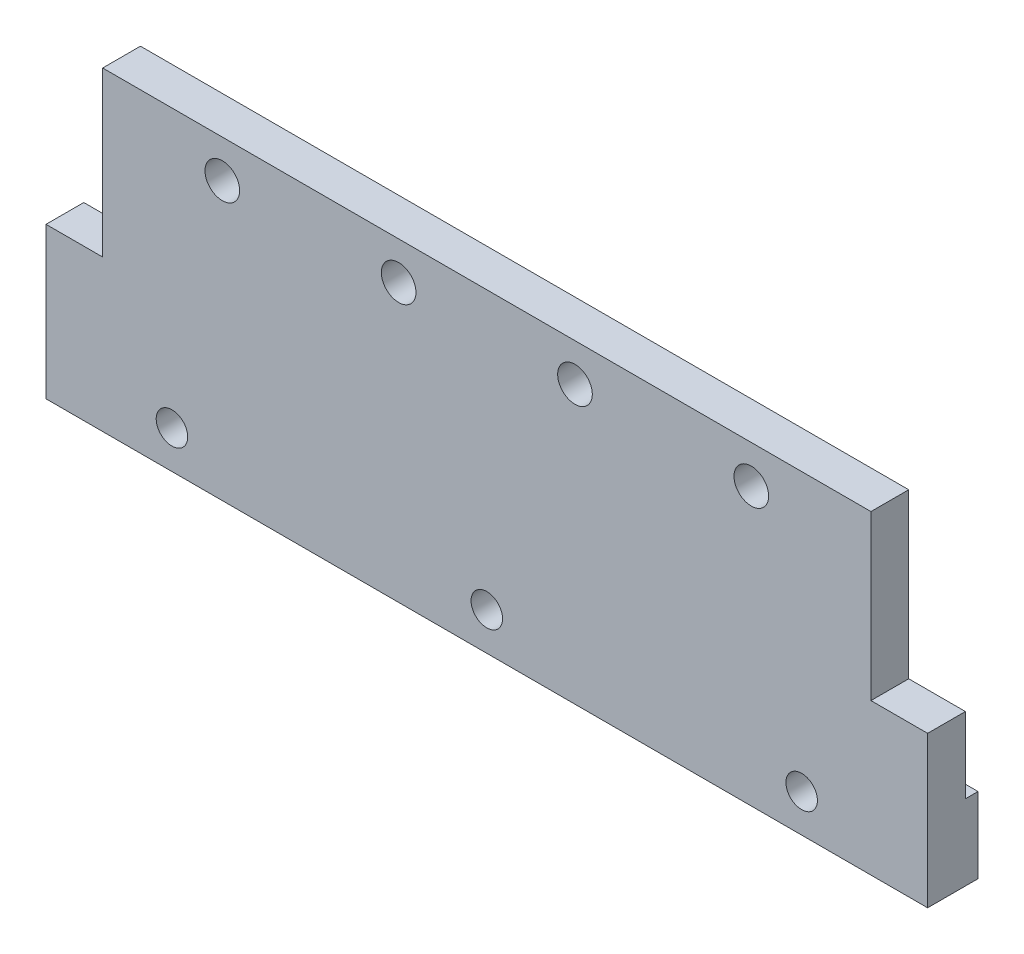
ISO-10303-21;
HEADER;
FILE_DESCRIPTION(('STEP AP214'),'2;1');
FILE_NAME('part.step','',(''),(''),'','','');
FILE_SCHEMA(('AUTOMOTIVE_DESIGN { 1 0 10303 214 1 1 1 1 }'));
ENDSEC;
DATA;
#1=APPLICATION_CONTEXT('core data for automotive mechanical design processes');
#2=APPLICATION_PROTOCOL_DEFINITION('international standard','automotive_design',2000,#1);
#3=PRODUCT_CONTEXT('',#1,'mechanical');
#4=PRODUCT('Part','Part','',(#3));
#5=PRODUCT_RELATED_PRODUCT_CATEGORY('part','',(#4));
#6=PRODUCT_DEFINITION_FORMATION('','',#4);
#7=PRODUCT_DEFINITION_CONTEXT('part definition',#1,'design');
#8=PRODUCT_DEFINITION('design','',#6,#7);
#9=PRODUCT_DEFINITION_SHAPE('','',#8);
#10=(LENGTH_UNIT() NAMED_UNIT(*) SI_UNIT(.MILLI.,.METRE.));
#11=(NAMED_UNIT(*) PLANE_ANGLE_UNIT() SI_UNIT($,.RADIAN.));
#12=(NAMED_UNIT(*) SI_UNIT($,.STERADIAN.) SOLID_ANGLE_UNIT());
#13=UNCERTAINTY_MEASURE_WITH_UNIT(LENGTH_MEASURE(1.E-05),#10,'distance_accuracy_value','');
#14=(GEOMETRIC_REPRESENTATION_CONTEXT(3) GLOBAL_UNCERTAINTY_ASSIGNED_CONTEXT((#13)) GLOBAL_UNIT_ASSIGNED_CONTEXT((#10,
#11,#12)) REPRESENTATION_CONTEXT('',''));
#15=CARTESIAN_POINT('',(0.,0.,0.));
#16=DIRECTION('',(0.,0.,1.));
#17=DIRECTION('',(1.,0.,0.));
#18=AXIS2_PLACEMENT_3D('',#15,#16,#17);
#19=CARTESIAN_POINT('',(70.,-25.,6.));
#20=DIRECTION('',(-1.,0.,0.));
#21=DIRECTION('',(0.,0.,1.));
#22=AXIS2_PLACEMENT_3D('',#19,#20,#21);
#23=PLANE('',#22);
#24=DIRECTION('',(0.,1.,0.));
#25=VECTOR('',#24,1.);
#26=CARTESIAN_POINT('',(70.,-25.,0.));
#27=LINE('',#26,#25);
#28=CARTESIAN_POINT('',(70.,-13.,0.));
#29=VERTEX_POINT('',#28);
#30=CARTESIAN_POINT('',(70.,-0.999999999999997,0.));
#31=VERTEX_POINT('',#30);
#32=EDGE_CURVE('E148',#29,#31,#27,.T.);
#33=ORIENTED_EDGE('',*,*,#32,.T.);
#34=DIRECTION('',(0.,0.,1.));
#35=VECTOR('',#34,1.);
#36=CARTESIAN_POINT('',(70.,-0.999999999999997,-2.000025));
#37=LINE('',#36,#35);
#38=CARTESIAN_POINT('',(70.,-0.999999999999997,6.));
#39=VERTEX_POINT('',#38);
#40=EDGE_CURVE('E226',#31,#39,#37,.T.);
#41=ORIENTED_EDGE('',*,*,#40,.T.);
#42=DIRECTION('',(0.,1.,0.));
#43=VECTOR('',#42,1.);
#44=CARTESIAN_POINT('',(70.,-25.,6.));
#45=LINE('',#44,#43);
#46=CARTESIAN_POINT('',(70.,-25.,6.));
#47=VERTEX_POINT('',#46);
#48=EDGE_CURVE('E133',#47,#39,#45,.T.);
#49=ORIENTED_EDGE('',*,*,#48,.F.);
#50=DIRECTION('',(0.,0.,-1.));
#51=VECTOR('',#50,1.);
#52=CARTESIAN_POINT('',(70.,-25.,6.));
#53=LINE('',#52,#51);
#54=CARTESIAN_POINT('',(70.,-25.,-2.));
#55=VERTEX_POINT('',#54);
#56=EDGE_CURVE('E142',#47,#55,#53,.T.);
#57=ORIENTED_EDGE('',*,*,#56,.T.);
#58=DIRECTION('',(0.,-1.,0.));
#59=VECTOR('',#58,1.);
#60=CARTESIAN_POINT('',(70.,-25.,-2.));
#61=LINE('',#60,#59);
#62=CARTESIAN_POINT('',(70.,-13.,-2.));
#63=VERTEX_POINT('',#62);
#64=EDGE_CURVE('E301',#63,#55,#61,.T.);
#65=ORIENTED_EDGE('',*,*,#64,.F.);
#66=DIRECTION('',(0.,0.,1.));
#67=VECTOR('',#66,1.);
#68=CARTESIAN_POINT('',(70.,-13.,-2.));
#69=LINE('',#68,#67);
#70=EDGE_CURVE('E161',#63,#29,#69,.T.);
#71=ORIENTED_EDGE('',*,*,#70,.T.);
#72=EDGE_LOOP('',(#33,#41,#49,#57,#65,#71));
#73=FACE_BOUND('',#72,.T.);
#74=ADVANCED_FACE('F37',(#73),#23,.F.);
#75=CARTESIAN_POINT('',(-70.,25.,6.));
#76=DIRECTION('',(0.,-1.,0.));
#77=DIRECTION('',(0.,0.,-1.));
#78=AXIS2_PLACEMENT_3D('',#75,#76,#77);
#79=PLANE('',#78);
#80=DIRECTION('',(-1.,0.,0.));
#81=VECTOR('',#80,1.);
#82=CARTESIAN_POINT('',(-70.,25.,6.));
#83=LINE('',#82,#81);
#84=CARTESIAN_POINT('',(61.,25.,6.));
#85=VERTEX_POINT('',#84);
#86=CARTESIAN_POINT('',(-61.,25.,6.));
#87=VERTEX_POINT('',#86);
#88=EDGE_CURVE('E125',#85,#87,#83,.T.);
#89=ORIENTED_EDGE('',*,*,#88,.F.);
#90=DIRECTION('',(0.,0.,1.));
#91=VECTOR('',#90,1.);
#92=CARTESIAN_POINT('',(61.,25.,-2.000025));
#93=LINE('',#92,#91);
#94=CARTESIAN_POINT('',(61.,25.,0.));
#95=VERTEX_POINT('',#94);
#96=EDGE_CURVE('E110',#95,#85,#93,.T.);
#97=ORIENTED_EDGE('',*,*,#96,.F.);
#98=DIRECTION('',(-1.,0.,0.));
#99=VECTOR('',#98,1.);
#100=CARTESIAN_POINT('',(-70.,25.,0.));
#101=LINE('',#100,#99);
#102=CARTESIAN_POINT('',(-61.,25.,0.));
#103=VERTEX_POINT('',#102);
#104=EDGE_CURVE('E145',#95,#103,#101,.T.);
#105=ORIENTED_EDGE('',*,*,#104,.T.);
#106=DIRECTION('',(0.,0.,1.));
#107=VECTOR('',#106,1.);
#108=CARTESIAN_POINT('',(-61.,25.,-2.000025));
#109=LINE('',#108,#107);
#110=EDGE_CURVE('E131',#103,#87,#109,.T.);
#111=ORIENTED_EDGE('',*,*,#110,.T.);
#112=EDGE_LOOP('',(#89,#97,#105,#111));
#113=FACE_BOUND('',#112,.T.);
#114=ADVANCED_FACE('F129',(#113),#79,.F.);
#115=CARTESIAN_POINT('',(-70.,-25.,6.));
#116=DIRECTION('',(1.,0.,0.));
#117=DIRECTION('',(0.,0.,-1.));
#118=AXIS2_PLACEMENT_3D('',#115,#116,#117);
#119=PLANE('',#118);
#120=DIRECTION('',(0.,-1.,0.));
#121=VECTOR('',#120,1.);
#122=CARTESIAN_POINT('',(-70.,-25.,6.));
#123=LINE('',#122,#121);
#124=CARTESIAN_POINT('',(-70.,-0.999999999999997,6.));
#125=VERTEX_POINT('',#124);
#126=CARTESIAN_POINT('',(-70.,-25.,6.));
#127=VERTEX_POINT('',#126);
#128=EDGE_CURVE('E132',#125,#127,#123,.T.);
#129=ORIENTED_EDGE('',*,*,#128,.F.);
#130=DIRECTION('',(0.,0.,1.));
#131=VECTOR('',#130,1.);
#132=CARTESIAN_POINT('',(-70.,-0.999999999999997,-2.000025));
#133=LINE('',#132,#131);
#134=CARTESIAN_POINT('',(-70.,-0.999999999999997,0.));
#135=VERTEX_POINT('',#134);
#136=EDGE_CURVE('E277',#135,#125,#133,.T.);
#137=ORIENTED_EDGE('',*,*,#136,.F.);
#138=DIRECTION('',(0.,-1.,0.));
#139=VECTOR('',#138,1.);
#140=CARTESIAN_POINT('',(-70.,-25.,0.));
#141=LINE('',#140,#139);
#142=CARTESIAN_POINT('',(-70.,-13.,0.));
#143=VERTEX_POINT('',#142);
#144=EDGE_CURVE('E137',#135,#143,#141,.T.);
#145=ORIENTED_EDGE('',*,*,#144,.T.);
#146=DIRECTION('',(0.,0.,1.));
#147=VECTOR('',#146,1.);
#148=CARTESIAN_POINT('',(-70.,-13.,-2.));
#149=LINE('',#148,#147);
#150=CARTESIAN_POINT('',(-70.,-13.,-2.));
#151=VERTEX_POINT('',#150);
#152=EDGE_CURVE('E175',#151,#143,#149,.T.);
#153=ORIENTED_EDGE('',*,*,#152,.F.);
#154=DIRECTION('',(0.,1.,0.));
#155=VECTOR('',#154,1.);
#156=CARTESIAN_POINT('',(-70.,-25.,-2.));
#157=LINE('',#156,#155);
#158=CARTESIAN_POINT('',(-70.,-25.,-2.));
#159=VERTEX_POINT('',#158);
#160=EDGE_CURVE('E159',#159,#151,#157,.T.);
#161=ORIENTED_EDGE('',*,*,#160,.F.);
#162=DIRECTION('',(0.,0.,-1.));
#163=VECTOR('',#162,1.);
#164=CARTESIAN_POINT('',(-70.,-25.,6.));
#165=LINE('',#164,#163);
#166=EDGE_CURVE('E153',#127,#159,#165,.T.);
#167=ORIENTED_EDGE('',*,*,#166,.F.);
#168=EDGE_LOOP('',(#129,#137,#145,#153,#161,#167));
#169=FACE_BOUND('',#168,.T.);
#170=ADVANCED_FACE('F222',(#169),#119,.F.);
#171=CARTESIAN_POINT('',(-70.,-25.,6.));
#172=DIRECTION('',(0.,1.,0.));
#173=DIRECTION('',(0.,0.,1.));
#174=AXIS2_PLACEMENT_3D('',#171,#172,#173);
#175=PLANE('',#174);
#176=ORIENTED_EDGE('',*,*,#166,.T.);
#177=DIRECTION('',(-1.,0.,0.));
#178=VECTOR('',#177,1.);
#179=CARTESIAN_POINT('',(-70.,-25.,-2.));
#180=LINE('',#179,#178);
#181=EDGE_CURVE('E166',#55,#159,#180,.T.);
#182=ORIENTED_EDGE('',*,*,#181,.F.);
#183=ORIENTED_EDGE('',*,*,#56,.F.);
#184=DIRECTION('',(1.,0.,0.));
#185=VECTOR('',#184,1.);
#186=CARTESIAN_POINT('',(-70.,-25.,6.));
#187=LINE('',#186,#185);
#188=EDGE_CURVE('E135',#127,#47,#187,.T.);
#189=ORIENTED_EDGE('',*,*,#188,.F.);
#190=EDGE_LOOP('',(#176,#182,#183,#189));
#191=FACE_BOUND('',#190,.T.);
#192=ADVANCED_FACE('F211',(#191),#175,.F.);
#193=CARTESIAN_POINT('',(70.,25.,6.));
#194=DIRECTION('',(0.,0.,-1.));
#195=DIRECTION('',(-1.,0.,0.));
#196=AXIS2_PLACEMENT_3D('',#193,#194,#195);
#197=PLANE('',#196);
#198=CARTESIAN_POINT('',(0.,-19.,6.));
#199=DIRECTION('',(0.,0.,1.));
#200=DIRECTION('',(1.,0.,0.));
#201=AXIS2_PLACEMENT_3D('',#198,#199,#200);
#202=CIRCLE('',#201,2.5);
#203=CARTESIAN_POINT('',(2.5,-19.,6.));
#204=VERTEX_POINT('',#203);
#205=EDGE_CURVE('E286',#204,#204,#202,.T.);
#206=ORIENTED_EDGE('',*,*,#205,.F.);
#207=EDGE_LOOP('',(#206));
#208=FACE_BOUND('',#207,.T.);
#209=CARTESIAN_POINT('',(-50.,-19.,6.));
#210=DIRECTION('',(0.,0.,1.));
#211=DIRECTION('',(1.,0.,0.));
#212=AXIS2_PLACEMENT_3D('',#209,#210,#211);
#213=CIRCLE('',#212,2.5);
#214=CARTESIAN_POINT('',(-47.5,-19.,6.));
#215=VERTEX_POINT('',#214);
#216=EDGE_CURVE('E257',#215,#215,#213,.T.);
#217=ORIENTED_EDGE('',*,*,#216,.F.);
#218=EDGE_LOOP('',(#217));
#219=FACE_BOUND('',#218,.T.);
#220=CARTESIAN_POINT('',(50.,-19.,6.));
#221=DIRECTION('',(0.,0.,1.));
#222=DIRECTION('',(1.,0.,0.));
#223=AXIS2_PLACEMENT_3D('',#220,#221,#222);
#224=CIRCLE('',#223,2.5);
#225=CARTESIAN_POINT('',(52.5,-19.,6.));
#226=VERTEX_POINT('',#225);
#227=EDGE_CURVE('E252',#226,#226,#224,.T.);
#228=ORIENTED_EDGE('',*,*,#227,.F.);
#229=EDGE_LOOP('',(#228));
#230=FACE_BOUND('',#229,.T.);
#231=CARTESIAN_POINT('',(42.,19.,6.));
#232=DIRECTION('',(0.,0.,-1.));
#233=DIRECTION('',(-1.,0.,0.));
#234=AXIS2_PLACEMENT_3D('',#231,#232,#233);
#235=CIRCLE('',#234,2.75);
#236=CARTESIAN_POINT('',(39.25,19.,6.));
#237=VERTEX_POINT('',#236);
#238=EDGE_CURVE('E168',#237,#237,#235,.T.);
#239=ORIENTED_EDGE('',*,*,#238,.T.);
#240=EDGE_LOOP('',(#239));
#241=FACE_BOUND('',#240,.T.);
#242=CARTESIAN_POINT('',(14.,19.,6.));
#243=DIRECTION('',(0.,0.,-1.));
#244=DIRECTION('',(-1.,0.,0.));
#245=AXIS2_PLACEMENT_3D('',#242,#243,#244);
#246=CIRCLE('',#245,2.75);
#247=CARTESIAN_POINT('',(11.25,19.,6.));
#248=VERTEX_POINT('',#247);
#249=EDGE_CURVE('E176',#248,#248,#246,.T.);
#250=ORIENTED_EDGE('',*,*,#249,.T.);
#251=EDGE_LOOP('',(#250));
#252=FACE_BOUND('',#251,.T.);
#253=CARTESIAN_POINT('',(-14.,19.,6.));
#254=DIRECTION('',(0.,0.,-1.));
#255=DIRECTION('',(-1.,0.,0.));
#256=AXIS2_PLACEMENT_3D('',#253,#254,#255);
#257=CIRCLE('',#256,2.75);
#258=CARTESIAN_POINT('',(-16.75,19.,6.));
#259=VERTEX_POINT('',#258);
#260=EDGE_CURVE('E184',#259,#259,#257,.T.);
#261=ORIENTED_EDGE('',*,*,#260,.T.);
#262=EDGE_LOOP('',(#261));
#263=FACE_BOUND('',#262,.T.);
#264=CARTESIAN_POINT('',(-42.,19.,6.));
#265=DIRECTION('',(0.,0.,-1.));
#266=DIRECTION('',(-1.,0.,0.));
#267=AXIS2_PLACEMENT_3D('',#264,#265,#266);
#268=CIRCLE('',#267,2.75);
#269=CARTESIAN_POINT('',(-44.75,19.,6.));
#270=VERTEX_POINT('',#269);
#271=EDGE_CURVE('E152',#270,#270,#268,.T.);
#272=ORIENTED_EDGE('',*,*,#271,.T.);
#273=EDGE_LOOP('',(#272));
#274=FACE_BOUND('',#273,.T.);
#275=ORIENTED_EDGE('',*,*,#48,.T.);
#276=DIRECTION('',(1.,0.,0.));
#277=VECTOR('',#276,1.);
#278=CARTESIAN_POINT('',(70.,-0.999999999999997,6.));
#279=LINE('',#278,#277);
#280=CARTESIAN_POINT('',(61.,-0.999999999999999,6.));
#281=VERTEX_POINT('',#280);
#282=EDGE_CURVE('E119',#281,#39,#279,.T.);
#283=ORIENTED_EDGE('',*,*,#282,.F.);
#284=DIRECTION('',(0.,-1.,0.));
#285=VECTOR('',#284,1.);
#286=CARTESIAN_POINT('',(61.,25.,6.));
#287=LINE('',#286,#285);
#288=EDGE_CURVE('E113',#85,#281,#287,.T.);
#289=ORIENTED_EDGE('',*,*,#288,.F.);
#290=ORIENTED_EDGE('',*,*,#88,.T.);
#291=DIRECTION('',(0.,1.,0.));
#292=VECTOR('',#291,1.);
#293=CARTESIAN_POINT('',(-61.,25.,6.));
#294=LINE('',#293,#292);
#295=CARTESIAN_POINT('',(-61.,-0.999999999999997,6.));
#296=VERTEX_POINT('',#295);
#297=EDGE_CURVE('E279',#296,#87,#294,.T.);
#298=ORIENTED_EDGE('',*,*,#297,.F.);
#299=DIRECTION('',(1.,0.,0.));
#300=VECTOR('',#299,1.);
#301=CARTESIAN_POINT('',(-70.,-0.999999999999997,6.));
#302=LINE('',#301,#300);
#303=EDGE_CURVE('E282',#125,#296,#302,.T.);
#304=ORIENTED_EDGE('',*,*,#303,.F.);
#305=ORIENTED_EDGE('',*,*,#128,.T.);
#306=ORIENTED_EDGE('',*,*,#188,.T.);
#307=EDGE_LOOP('',(#275,#283,#289,#290,#298,#304,#305,#306));
#308=FACE_BOUND('',#307,.T.);
#309=ADVANCED_FACE('F123',(#208,#219,#230,#241,#252,#263,#274,#308),#197,.F.);
#310=CARTESIAN_POINT('',(70.,25.,0.));
#311=DIRECTION('',(0.,0.,-1.));
#312=DIRECTION('',(-1.,0.,0.));
#313=AXIS2_PLACEMENT_3D('',#310,#311,#312);
#314=PLANE('',#313);
#315=DIRECTION('',(-1.,0.,0.));
#316=VECTOR('',#315,1.);
#317=CARTESIAN_POINT('',(70.,-0.999999999999997,0.));
#318=LINE('',#317,#316);
#319=CARTESIAN_POINT('',(61.,-0.999999999999997,0.));
#320=VERTEX_POINT('',#319);
#321=EDGE_CURVE('E11',#31,#320,#318,.T.);
#322=ORIENTED_EDGE('',*,*,#321,.F.);
#323=ORIENTED_EDGE('',*,*,#32,.F.);
#324=DIRECTION('',(1.,0.,0.));
#325=VECTOR('',#324,1.);
#326=CARTESIAN_POINT('',(-70.,-13.,0.));
#327=LINE('',#326,#325);
#328=EDGE_CURVE('E155',#143,#29,#327,.T.);
#329=ORIENTED_EDGE('',*,*,#328,.F.);
#330=ORIENTED_EDGE('',*,*,#144,.F.);
#331=DIRECTION('',(-1.,0.,0.));
#332=VECTOR('',#331,1.);
#333=CARTESIAN_POINT('',(70.,-0.999999999999997,0.));
#334=LINE('',#333,#332);
#335=CARTESIAN_POINT('',(-61.,-0.999999999999997,0.));
#336=VERTEX_POINT('',#335);
#337=EDGE_CURVE('E260',#336,#135,#334,.T.);
#338=ORIENTED_EDGE('',*,*,#337,.F.);
#339=DIRECTION('',(0.,-1.,0.));
#340=VECTOR('',#339,1.);
#341=CARTESIAN_POINT('',(-61.,25.,0.));
#342=LINE('',#341,#340);
#343=EDGE_CURVE('E270',#103,#336,#342,.T.);
#344=ORIENTED_EDGE('',*,*,#343,.F.);
#345=ORIENTED_EDGE('',*,*,#104,.F.);
#346=DIRECTION('',(0.,1.,0.));
#347=VECTOR('',#346,1.);
#348=CARTESIAN_POINT('',(61.,25.,0.));
#349=LINE('',#348,#347);
#350=EDGE_CURVE('E44',#320,#95,#349,.T.);
#351=ORIENTED_EDGE('',*,*,#350,.F.);
#352=EDGE_LOOP('',(#322,#323,#329,#330,#338,#344,#345,#351));
#353=FACE_BOUND('',#352,.T.);
#354=CARTESIAN_POINT('',(42.,19.,0.));
#355=DIRECTION('',(0.,0.,-1.));
#356=DIRECTION('',(-1.,0.,0.));
#357=AXIS2_PLACEMENT_3D('',#354,#355,#356);
#358=CIRCLE('',#357,2.75);
#359=CARTESIAN_POINT('',(39.25,19.,0.));
#360=VERTEX_POINT('',#359);
#361=EDGE_CURVE('E172',#360,#360,#358,.T.);
#362=ORIENTED_EDGE('',*,*,#361,.F.);
#363=EDGE_LOOP('',(#362));
#364=FACE_BOUND('',#363,.T.);
#365=CARTESIAN_POINT('',(14.,19.,0.));
#366=DIRECTION('',(0.,0.,-1.));
#367=DIRECTION('',(-1.,0.,0.));
#368=AXIS2_PLACEMENT_3D('',#365,#366,#367);
#369=CIRCLE('',#368,2.75);
#370=CARTESIAN_POINT('',(11.25,19.,0.));
#371=VERTEX_POINT('',#370);
#372=EDGE_CURVE('E171',#371,#371,#369,.T.);
#373=ORIENTED_EDGE('',*,*,#372,.F.);
#374=EDGE_LOOP('',(#373));
#375=FACE_BOUND('',#374,.T.);
#376=CARTESIAN_POINT('',(-14.,19.,0.));
#377=DIRECTION('',(0.,0.,-1.));
#378=DIRECTION('',(-1.,0.,0.));
#379=AXIS2_PLACEMENT_3D('',#376,#377,#378);
#380=CIRCLE('',#379,2.75);
#381=CARTESIAN_POINT('',(-16.75,19.,0.));
#382=VERTEX_POINT('',#381);
#383=EDGE_CURVE('E180',#382,#382,#380,.T.);
#384=ORIENTED_EDGE('',*,*,#383,.F.);
#385=EDGE_LOOP('',(#384));
#386=FACE_BOUND('',#385,.T.);
#387=CARTESIAN_POINT('',(-42.,19.,0.));
#388=DIRECTION('',(0.,0.,-1.));
#389=DIRECTION('',(-1.,0.,0.));
#390=AXIS2_PLACEMENT_3D('',#387,#388,#389);
#391=CIRCLE('',#390,2.75);
#392=CARTESIAN_POINT('',(-44.75,19.,0.));
#393=VERTEX_POINT('',#392);
#394=EDGE_CURVE('E187',#393,#393,#391,.T.);
#395=ORIENTED_EDGE('',*,*,#394,.F.);
#396=EDGE_LOOP('',(#395));
#397=FACE_BOUND('',#396,.T.);
#398=ADVANCED_FACE('F200',(#353,#364,#375,#386,#397),#314,.T.);
#399=CARTESIAN_POINT('',(-42.,19.,6.));
#400=DIRECTION('',(0.,0.,-1.));
#401=DIRECTION('',(-1.,0.,0.));
#402=AXIS2_PLACEMENT_3D('',#399,#400,#401);
#403=CYLINDRICAL_SURFACE('',#402,2.75);
#404=ORIENTED_EDGE('',*,*,#271,.F.);
#405=EDGE_LOOP('',(#404));
#406=FACE_BOUND('',#405,.T.);
#407=ORIENTED_EDGE('',*,*,#394,.T.);
#408=EDGE_LOOP('',(#407));
#409=FACE_BOUND('',#408,.T.);
#410=ADVANCED_FACE('F198',(#406,#409),#403,.F.);
#411=CARTESIAN_POINT('',(-14.,19.,6.));
#412=DIRECTION('',(0.,0.,-1.));
#413=DIRECTION('',(-1.,0.,0.));
#414=AXIS2_PLACEMENT_3D('',#411,#412,#413);
#415=CYLINDRICAL_SURFACE('',#414,2.75);
#416=ORIENTED_EDGE('',*,*,#260,.F.);
#417=EDGE_LOOP('',(#416));
#418=FACE_BOUND('',#417,.T.);
#419=ORIENTED_EDGE('',*,*,#383,.T.);
#420=EDGE_LOOP('',(#419));
#421=FACE_BOUND('',#420,.T.);
#422=ADVANCED_FACE('F208',(#418,#421),#415,.F.);
#423=CARTESIAN_POINT('',(14.,19.,6.));
#424=DIRECTION('',(0.,0.,-1.));
#425=DIRECTION('',(-1.,0.,0.));
#426=AXIS2_PLACEMENT_3D('',#423,#424,#425);
#427=CYLINDRICAL_SURFACE('',#426,2.75);
#428=ORIENTED_EDGE('',*,*,#249,.F.);
#429=EDGE_LOOP('',(#428));
#430=FACE_BOUND('',#429,.T.);
#431=ORIENTED_EDGE('',*,*,#372,.T.);
#432=EDGE_LOOP('',(#431));
#433=FACE_BOUND('',#432,.T.);
#434=ADVANCED_FACE('F354',(#430,#433),#427,.F.);
#435=CARTESIAN_POINT('',(42.,19.,6.));
#436=DIRECTION('',(0.,0.,-1.));
#437=DIRECTION('',(-1.,0.,0.));
#438=AXIS2_PLACEMENT_3D('',#435,#436,#437);
#439=CYLINDRICAL_SURFACE('',#438,2.75);
#440=ORIENTED_EDGE('',*,*,#238,.F.);
#441=EDGE_LOOP('',(#440));
#442=FACE_BOUND('',#441,.T.);
#443=ORIENTED_EDGE('',*,*,#361,.T.);
#444=EDGE_LOOP('',(#443));
#445=FACE_BOUND('',#444,.T.);
#446=ADVANCED_FACE('F351',(#442,#445),#439,.F.);
#447=CARTESIAN_POINT('',(-70.,-13.,-2.));
#448=DIRECTION('',(0.,-1.,0.));
#449=DIRECTION('',(1.,0.,0.));
#450=AXIS2_PLACEMENT_3D('',#447,#448,#449);
#451=PLANE('',#450);
#452=ORIENTED_EDGE('',*,*,#328,.T.);
#453=ORIENTED_EDGE('',*,*,#70,.F.);
#454=DIRECTION('',(1.,0.,0.));
#455=VECTOR('',#454,1.);
#456=CARTESIAN_POINT('',(-70.,-13.,-2.));
#457=LINE('',#456,#455);
#458=EDGE_CURVE('E235',#151,#63,#457,.T.);
#459=ORIENTED_EDGE('',*,*,#458,.F.);
#460=ORIENTED_EDGE('',*,*,#152,.T.);
#461=EDGE_LOOP('',(#452,#453,#459,#460));
#462=FACE_BOUND('',#461,.T.);
#463=ADVANCED_FACE('F233',(#462),#451,.F.);
#464=CARTESIAN_POINT('',(-70.,-13.,-2.));
#465=DIRECTION('',(0.,0.,-1.));
#466=DIRECTION('',(-1.,0.,0.));
#467=AXIS2_PLACEMENT_3D('',#464,#465,#466);
#468=PLANE('',#467);
#469=CARTESIAN_POINT('',(0.,-19.,-2.));
#470=DIRECTION('',(0.,0.,-1.));
#471=DIRECTION('',(-1.,0.,0.));
#472=AXIS2_PLACEMENT_3D('',#469,#470,#471);
#473=CIRCLE('',#472,3.249975);
#474=CARTESIAN_POINT('',(-3.249975,-19.,-2.));
#475=VERTEX_POINT('',#474);
#476=EDGE_CURVE('E254',#475,#475,#473,.T.);
#477=ORIENTED_EDGE('',*,*,#476,.F.);
#478=EDGE_LOOP('',(#477));
#479=FACE_BOUND('',#478,.T.);
#480=CARTESIAN_POINT('',(-50.,-19.,-2.));
#481=DIRECTION('',(0.,0.,-1.));
#482=DIRECTION('',(-1.,0.,0.));
#483=AXIS2_PLACEMENT_3D('',#480,#481,#482);
#484=CIRCLE('',#483,3.24997499999999);
#485=CARTESIAN_POINT('',(-53.249975,-19.,-2.));
#486=VERTEX_POINT('',#485);
#487=EDGE_CURVE('E248',#486,#486,#484,.T.);
#488=ORIENTED_EDGE('',*,*,#487,.F.);
#489=EDGE_LOOP('',(#488));
#490=FACE_BOUND('',#489,.T.);
#491=CARTESIAN_POINT('',(50.,-19.,-2.));
#492=DIRECTION('',(0.,0.,-1.));
#493=DIRECTION('',(-1.,0.,0.));
#494=AXIS2_PLACEMENT_3D('',#491,#492,#493);
#495=CIRCLE('',#494,3.24997499999999);
#496=CARTESIAN_POINT('',(46.750025,-19.,-2.));
#497=VERTEX_POINT('',#496);
#498=EDGE_CURVE('E160',#497,#497,#495,.T.);
#499=ORIENTED_EDGE('',*,*,#498,.F.);
#500=EDGE_LOOP('',(#499));
#501=FACE_BOUND('',#500,.T.);
#502=ORIENTED_EDGE('',*,*,#160,.T.);
#503=ORIENTED_EDGE('',*,*,#458,.T.);
#504=ORIENTED_EDGE('',*,*,#64,.T.);
#505=ORIENTED_EDGE('',*,*,#181,.T.);
#506=EDGE_LOOP('',(#502,#503,#504,#505));
#507=FACE_BOUND('',#506,.T.);
#508=ADVANCED_FACE('F303',(#479,#490,#501,#507),#468,.T.);
#509=CARTESIAN_POINT('',(50.,-19.,-1.250025));
#510=DIRECTION('',(0.,0.,-1.));
#511=DIRECTION('',(-1.,0.,0.));
#512=AXIS2_PLACEMENT_3D('',#509,#510,#511);
#513=CONICAL_SURFACE('',#512,2.5,0.785398163397448);
#514=ORIENTED_EDGE('',*,*,#498,.T.);
#515=EDGE_LOOP('',(#514));
#516=FACE_BOUND('',#515,.T.);
#517=CARTESIAN_POINT('',(50.,-19.,-1.250025));
#518=DIRECTION('',(0.,0.,1.));
#519=DIRECTION('',(1.,0.,0.));
#520=AXIS2_PLACEMENT_3D('',#517,#518,#519);
#521=CIRCLE('',#520,2.5);
#522=CARTESIAN_POINT('',(52.5,-19.,-1.250025));
#523=VERTEX_POINT('',#522);
#524=EDGE_CURVE('E247',#523,#523,#521,.T.);
#525=ORIENTED_EDGE('',*,*,#524,.T.);
#526=EDGE_LOOP('',(#525));
#527=FACE_BOUND('',#526,.T.);
#528=ADVANCED_FACE('F341',(#516,#527),#513,.F.);
#529=CARTESIAN_POINT('',(50.,-19.,6.));
#530=DIRECTION('',(0.,0.,1.));
#531=DIRECTION('',(1.,0.,0.));
#532=AXIS2_PLACEMENT_3D('',#529,#530,#531);
#533=CYLINDRICAL_SURFACE('',#532,2.5);
#534=ORIENTED_EDGE('',*,*,#524,.F.);
#535=EDGE_LOOP('',(#534));
#536=FACE_BOUND('',#535,.T.);
#537=ORIENTED_EDGE('',*,*,#227,.T.);
#538=EDGE_LOOP('',(#537));
#539=FACE_BOUND('',#538,.T.);
#540=ADVANCED_FACE('F337',(#536,#539),#533,.F.);
#541=CARTESIAN_POINT('',(-50.,-19.,-1.250025));
#542=DIRECTION('',(0.,0.,-1.));
#543=DIRECTION('',(-1.,0.,0.));
#544=AXIS2_PLACEMENT_3D('',#541,#542,#543);
#545=CONICAL_SURFACE('',#544,2.5,0.785398163397448);
#546=ORIENTED_EDGE('',*,*,#487,.T.);
#547=EDGE_LOOP('',(#546));
#548=FACE_BOUND('',#547,.T.);
#549=CARTESIAN_POINT('',(-50.,-19.,-1.250025));
#550=DIRECTION('',(0.,0.,1.));
#551=DIRECTION('',(1.,0.,0.));
#552=AXIS2_PLACEMENT_3D('',#549,#550,#551);
#553=CIRCLE('',#552,2.5);
#554=CARTESIAN_POINT('',(-47.5,-19.,-1.250025));
#555=VERTEX_POINT('',#554);
#556=EDGE_CURVE('E253',#555,#555,#553,.T.);
#557=ORIENTED_EDGE('',*,*,#556,.T.);
#558=EDGE_LOOP('',(#557));
#559=FACE_BOUND('',#558,.T.);
#560=ADVANCED_FACE('F333',(#548,#559),#545,.F.);
#561=CARTESIAN_POINT('',(-50.,-19.,6.));
#562=DIRECTION('',(0.,0.,1.));
#563=DIRECTION('',(1.,0.,0.));
#564=AXIS2_PLACEMENT_3D('',#561,#562,#563);
#565=CYLINDRICAL_SURFACE('',#564,2.5);
#566=ORIENTED_EDGE('',*,*,#556,.F.);
#567=EDGE_LOOP('',(#566));
#568=FACE_BOUND('',#567,.T.);
#569=ORIENTED_EDGE('',*,*,#216,.T.);
#570=EDGE_LOOP('',(#569));
#571=FACE_BOUND('',#570,.T.);
#572=ADVANCED_FACE('F329',(#568,#571),#565,.F.);
#573=CARTESIAN_POINT('',(0.,-19.,-1.250025));
#574=DIRECTION('',(0.,0.,-1.));
#575=DIRECTION('',(-1.,0.,0.));
#576=AXIS2_PLACEMENT_3D('',#573,#574,#575);
#577=CONICAL_SURFACE('',#576,2.5,0.785398163397448);
#578=ORIENTED_EDGE('',*,*,#476,.T.);
#579=EDGE_LOOP('',(#578));
#580=FACE_BOUND('',#579,.T.);
#581=CARTESIAN_POINT('',(0.,-19.,-1.250025));
#582=DIRECTION('',(0.,0.,1.));
#583=DIRECTION('',(1.,0.,0.));
#584=AXIS2_PLACEMENT_3D('',#581,#582,#583);
#585=CIRCLE('',#584,2.5);
#586=CARTESIAN_POINT('',(2.5,-19.,-1.250025));
#587=VERTEX_POINT('',#586);
#588=EDGE_CURVE('E258',#587,#587,#585,.T.);
#589=ORIENTED_EDGE('',*,*,#588,.T.);
#590=EDGE_LOOP('',(#589));
#591=FACE_BOUND('',#590,.T.);
#592=ADVANCED_FACE('F325',(#580,#591),#577,.F.);
#593=CARTESIAN_POINT('',(0.,-19.,6.));
#594=DIRECTION('',(0.,0.,1.));
#595=DIRECTION('',(1.,0.,0.));
#596=AXIS2_PLACEMENT_3D('',#593,#594,#595);
#597=CYLINDRICAL_SURFACE('',#596,2.5);
#598=ORIENTED_EDGE('',*,*,#588,.F.);
#599=EDGE_LOOP('',(#598));
#600=FACE_BOUND('',#599,.T.);
#601=ORIENTED_EDGE('',*,*,#205,.T.);
#602=EDGE_LOOP('',(#601));
#603=FACE_BOUND('',#602,.T.);
#604=ADVANCED_FACE('F321',(#600,#603),#597,.F.);
#605=CARTESIAN_POINT('',(-61.,25.,-2.000025));
#606=DIRECTION('',(1.,0.,0.));
#607=DIRECTION('',(0.,0.,-1.));
#608=AXIS2_PLACEMENT_3D('',#605,#606,#607);
#609=PLANE('',#608);
#610=ORIENTED_EDGE('',*,*,#343,.T.);
#611=DIRECTION('',(0.,0.,1.));
#612=VECTOR('',#611,1.);
#613=CARTESIAN_POINT('',(-61.,-0.999999999999997,-2.000025));
#614=LINE('',#613,#612);
#615=EDGE_CURVE('E58',#336,#296,#614,.T.);
#616=ORIENTED_EDGE('',*,*,#615,.T.);
#617=ORIENTED_EDGE('',*,*,#297,.T.);
#618=ORIENTED_EDGE('',*,*,#110,.F.);
#619=EDGE_LOOP('',(#610,#616,#617,#618));
#620=FACE_BOUND('',#619,.T.);
#621=ADVANCED_FACE('F275',(#620),#609,.F.);
#622=CARTESIAN_POINT('',(-70.,-0.999999999999997,-2.000025));
#623=DIRECTION('',(0.,-1.,0.));
#624=DIRECTION('',(0.,0.,-1.));
#625=AXIS2_PLACEMENT_3D('',#622,#623,#624);
#626=PLANE('',#625);
#627=ORIENTED_EDGE('',*,*,#337,.T.);
#628=ORIENTED_EDGE('',*,*,#136,.T.);
#629=ORIENTED_EDGE('',*,*,#303,.T.);
#630=ORIENTED_EDGE('',*,*,#615,.F.);
#631=EDGE_LOOP('',(#627,#628,#629,#630));
#632=FACE_BOUND('',#631,.T.);
#633=ADVANCED_FACE('F311',(#632),#626,.F.);
#634=CARTESIAN_POINT('',(70.,-0.999999999999997,-2.000025));
#635=DIRECTION('',(0.,-1.,0.));
#636=DIRECTION('',(1.,0.,0.));
#637=AXIS2_PLACEMENT_3D('',#634,#635,#636);
#638=PLANE('',#637);
#639=ORIENTED_EDGE('',*,*,#321,.T.);
#640=DIRECTION('',(0.,0.,1.));
#641=VECTOR('',#640,1.);
#642=CARTESIAN_POINT('',(61.,-0.999999999999999,-2.000025));
#643=LINE('',#642,#641);
#644=EDGE_CURVE('E51',#320,#281,#643,.T.);
#645=ORIENTED_EDGE('',*,*,#644,.T.);
#646=ORIENTED_EDGE('',*,*,#282,.T.);
#647=ORIENTED_EDGE('',*,*,#40,.F.);
#648=EDGE_LOOP('',(#639,#645,#646,#647));
#649=FACE_BOUND('',#648,.T.);
#650=ADVANCED_FACE('F309',(#649),#638,.F.);
#651=CARTESIAN_POINT('',(61.,25.,-2.000025));
#652=DIRECTION('',(-1.,0.,0.));
#653=DIRECTION('',(0.,0.,1.));
#654=AXIS2_PLACEMENT_3D('',#651,#652,#653);
#655=PLANE('',#654);
#656=ORIENTED_EDGE('',*,*,#350,.T.);
#657=ORIENTED_EDGE('',*,*,#96,.T.);
#658=ORIENTED_EDGE('',*,*,#288,.T.);
#659=ORIENTED_EDGE('',*,*,#644,.F.);
#660=EDGE_LOOP('',(#656,#657,#658,#659));
#661=FACE_BOUND('',#660,.T.);
#662=ADVANCED_FACE('F112',(#661),#655,.F.);
#663=CLOSED_SHELL('',(#74,#114,#170,#192,#309,#398,#410,#422,#434,#446,#463,#508,#528,#540,#560,
#572,#592,#604,#621,#633,#650,#662));
#664=MANIFOLD_SOLID_BREP('B2',#663);
#665=ADVANCED_BREP_SHAPE_REPRESENTATION('',(#18,#664),#14);
#666=SHAPE_DEFINITION_REPRESENTATION(#9,#665);
ENDSEC;
END-ISO-10303-21;
